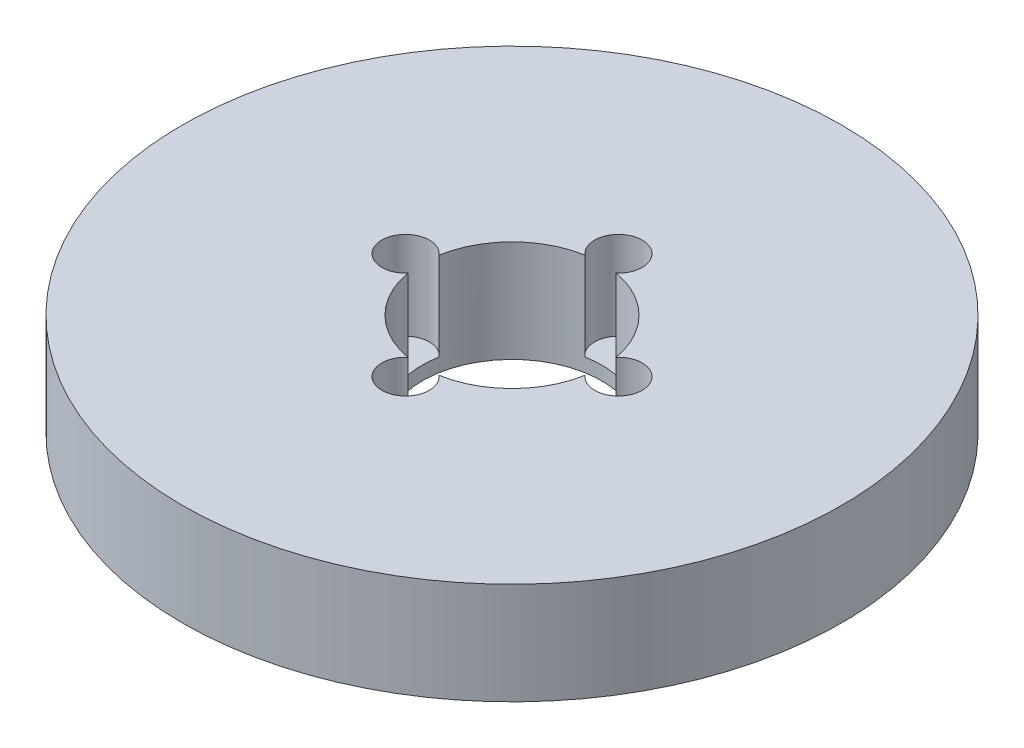
ISO-10303-21;
HEADER;
FILE_DESCRIPTION(('STEP AP214'),'2;1');
FILE_NAME('part.step','',(''),(''),'','','');
FILE_SCHEMA(('AUTOMOTIVE_DESIGN { 1 0 10303 214 1 1 1 1 }'));
ENDSEC;
DATA;
#1=APPLICATION_CONTEXT('core data for automotive mechanical design processes');
#2=APPLICATION_PROTOCOL_DEFINITION('international standard','automotive_design',2000,#1);
#3=PRODUCT_CONTEXT('',#1,'mechanical');
#4=PRODUCT('Part','Part','',(#3));
#5=PRODUCT_RELATED_PRODUCT_CATEGORY('part','',(#4));
#6=PRODUCT_DEFINITION_FORMATION('','',#4);
#7=PRODUCT_DEFINITION_CONTEXT('part definition',#1,'design');
#8=PRODUCT_DEFINITION('design','',#6,#7);
#9=PRODUCT_DEFINITION_SHAPE('','',#8);
#10=(LENGTH_UNIT() NAMED_UNIT(*) SI_UNIT(.MILLI.,.METRE.));
#11=(NAMED_UNIT(*) PLANE_ANGLE_UNIT() SI_UNIT($,.RADIAN.));
#12=(NAMED_UNIT(*) SI_UNIT($,.STERADIAN.) SOLID_ANGLE_UNIT());
#13=UNCERTAINTY_MEASURE_WITH_UNIT(LENGTH_MEASURE(1.E-05),#10,'distance_accuracy_value','');
#14=(GEOMETRIC_REPRESENTATION_CONTEXT(3) GLOBAL_UNCERTAINTY_ASSIGNED_CONTEXT((#13)) GLOBAL_UNIT_ASSIGNED_CONTEXT((#10,
#11,#12)) REPRESENTATION_CONTEXT('',''));
#15=CARTESIAN_POINT('',(0.,0.,0.));
#16=DIRECTION('',(0.,0.,1.));
#17=DIRECTION('',(1.,0.,0.));
#18=AXIS2_PLACEMENT_3D('',#15,#16,#17);
#19=CARTESIAN_POINT('',(0.,17.,0.));
#20=DIRECTION('',(0.,-1.,0.));
#21=DIRECTION('',(0.,0.,-1.));
#22=AXIS2_PLACEMENT_3D('',#19,#20,#21);
#23=CYLINDRICAL_SURFACE('',#22,55.);
#24=CARTESIAN_POINT('',(0.,17.,0.));
#25=DIRECTION('',(0.,1.,0.));
#26=DIRECTION('',(0.,0.,1.));
#27=AXIS2_PLACEMENT_3D('',#24,#25,#26);
#28=CIRCLE('',#27,55.);
#29=CARTESIAN_POINT('',(0.,17.,55.));
#30=VERTEX_POINT('',#29);
#31=EDGE_CURVE('E145',#30,#30,#28,.T.);
#32=ORIENTED_EDGE('',*,*,#31,.F.);
#33=EDGE_LOOP('',(#32));
#34=FACE_BOUND('',#33,.T.);
#35=CARTESIAN_POINT('',(0.,0.,0.));
#36=DIRECTION('',(0.,1.,0.));
#37=DIRECTION('',(0.,0.,1.));
#38=AXIS2_PLACEMENT_3D('',#35,#36,#37);
#39=CIRCLE('',#38,55.);
#40=CARTESIAN_POINT('',(0.,0.,55.));
#41=VERTEX_POINT('',#40);
#42=EDGE_CURVE('E143',#41,#41,#39,.T.);
#43=ORIENTED_EDGE('',*,*,#42,.T.);
#44=EDGE_LOOP('',(#43));
#45=FACE_BOUND('',#44,.T.);
#46=ADVANCED_FACE('F39',(#34,#45),#23,.T.);
#47=CARTESIAN_POINT('',(0.,17.,0.));
#48=DIRECTION('',(0.,1.,0.));
#49=DIRECTION('',(0.,0.,1.));
#50=AXIS2_PLACEMENT_3D('',#47,#48,#49);
#51=PLANE('',#50);
#52=CARTESIAN_POINT('',(0.,17.,17.7588888158018));
#53=DIRECTION('',(0.,1.,0.));
#54=DIRECTION('',(1.,0.,0.));
#55=AXIS2_PLACEMENT_3D('',#52,#53,#54);
#56=CIRCLE('',#55,3.96492053870155);
#57=CARTESIAN_POINT('',(-2.6071492899714,17.,14.7716882102149));
#58=VERTEX_POINT('',#57);
#59=CARTESIAN_POINT('',(2.6071492899715,17.,14.7716882102149));
#60=VERTEX_POINT('',#59);
#61=EDGE_CURVE('E152',#58,#60,#56,.T.);
#62=ORIENTED_EDGE('',*,*,#61,.F.);
#63=CARTESIAN_POINT('',(0.,17.,0.));
#64=DIRECTION('',(0.,1.,0.));
#65=DIRECTION('',(0.,0.,1.));
#66=AXIS2_PLACEMENT_3D('',#63,#64,#65);
#67=CIRCLE('',#66,15.);
#68=CARTESIAN_POINT('',(-14.7716882102149,17.,2.60714928997145));
#69=VERTEX_POINT('',#68);
#70=EDGE_CURVE('E133',#69,#58,#67,.T.);
#71=ORIENTED_EDGE('',*,*,#70,.F.);
#72=CARTESIAN_POINT('',(-17.7588888158018,17.,0.));
#73=DIRECTION('',(0.,1.,0.));
#74=DIRECTION('',(0.,0.,1.));
#75=AXIS2_PLACEMENT_3D('',#72,#73,#74);
#76=CIRCLE('',#75,3.96492053870155);
#77=CARTESIAN_POINT('',(-14.7716882102149,17.,-2.60714928997145));
#78=VERTEX_POINT('',#77);
#79=EDGE_CURVE('E128',#78,#69,#76,.T.);
#80=ORIENTED_EDGE('',*,*,#79,.F.);
#81=CARTESIAN_POINT('',(-2.60714928997161,17.,-14.7716882102149));
#82=VERTEX_POINT('',#81);
#83=EDGE_CURVE('E121',#82,#78,#67,.T.);
#84=ORIENTED_EDGE('',*,*,#83,.F.);
#85=CARTESIAN_POINT('',(-1.86014486696886E-13,17.,-17.7588888158018));
#86=DIRECTION('',(0.,1.,0.));
#87=DIRECTION('',(-1.,0.,0.));
#88=AXIS2_PLACEMENT_3D('',#85,#86,#87);
#89=CIRCLE('',#88,3.96492053870155);
#90=CARTESIAN_POINT('',(2.6071492899713,17.,-14.7716882102149));
#91=VERTEX_POINT('',#90);
#92=EDGE_CURVE('E105',#91,#82,#89,.T.);
#93=ORIENTED_EDGE('',*,*,#92,.F.);
#94=CARTESIAN_POINT('',(14.7716882102149,17.,-2.60714928997145));
#95=VERTEX_POINT('',#94);
#96=EDGE_CURVE('E131',#95,#91,#67,.T.);
#97=ORIENTED_EDGE('',*,*,#96,.F.);
#98=CARTESIAN_POINT('',(17.7588888158018,17.,0.));
#99=DIRECTION('',(0.,1.,0.));
#100=DIRECTION('',(0.,0.,-1.));
#101=AXIS2_PLACEMENT_3D('',#98,#99,#100);
#102=CIRCLE('',#101,3.96492053870155);
#103=CARTESIAN_POINT('',(14.7716882102149,17.,2.60714928997145));
#104=VERTEX_POINT('',#103);
#105=EDGE_CURVE('E154',#104,#95,#102,.T.);
#106=ORIENTED_EDGE('',*,*,#105,.F.);
#107=EDGE_CURVE('E134',#60,#104,#67,.T.);
#108=ORIENTED_EDGE('',*,*,#107,.F.);
#109=EDGE_LOOP('',(#62,#71,#80,#84,#93,#97,#106,#108));
#110=FACE_BOUND('',#109,.T.);
#111=ORIENTED_EDGE('',*,*,#31,.T.);
#112=EDGE_LOOP('',(#111));
#113=FACE_BOUND('',#112,.T.);
#114=ADVANCED_FACE('F130',(#110,#113),#51,.T.);
#115=CARTESIAN_POINT('',(0.,0.,0.));
#116=DIRECTION('',(0.,1.,0.));
#117=DIRECTION('',(0.,0.,1.));
#118=AXIS2_PLACEMENT_3D('',#115,#116,#117);
#119=PLANE('',#118);
#120=CARTESIAN_POINT('',(0.,0.,0.));
#121=DIRECTION('',(0.,1.,0.));
#122=DIRECTION('',(0.,0.,1.));
#123=AXIS2_PLACEMENT_3D('',#120,#121,#122);
#124=CIRCLE('',#123,15.);
#125=CARTESIAN_POINT('',(0.,0.,15.));
#126=VERTEX_POINT('',#125);
#127=EDGE_CURVE('E135',#126,#126,#124,.T.);
#128=ORIENTED_EDGE('',*,*,#127,.T.);
#129=EDGE_LOOP('',(#128));
#130=FACE_BOUND('',#129,.T.);
#131=ORIENTED_EDGE('',*,*,#42,.F.);
#132=EDGE_LOOP('',(#131));
#133=FACE_BOUND('',#132,.T.);
#134=ADVANCED_FACE('F195',(#130,#133),#119,.F.);
#135=CARTESIAN_POINT('',(0.,17.,0.));
#136=DIRECTION('',(0.,-1.,0.));
#137=DIRECTION('',(0.,0.,-1.));
#138=AXIS2_PLACEMENT_3D('',#135,#136,#137);
#139=CYLINDRICAL_SURFACE('',#138,15.);
#140=DIRECTION('',(0.,1.,0.));
#141=VECTOR('',#140,1.);
#142=CARTESIAN_POINT('',(-2.6071492899714,9.63967546323678,14.7716882102149));
#143=LINE('',#142,#141);
#144=CARTESIAN_POINT('',(-2.6071492899714,2.27935092647356,14.7716882102149));
#145=VERTEX_POINT('',#144);
#146=EDGE_CURVE('E11',#145,#58,#143,.T.);
#147=ORIENTED_EDGE('',*,*,#146,.F.);
#148=CARTESIAN_POINT('',(0.,2.27935092647356,0.));
#149=DIRECTION('',(0.,1.,0.));
#150=DIRECTION('',(0.,0.,1.));
#151=AXIS2_PLACEMENT_3D('',#148,#149,#150);
#152=CIRCLE('',#151,15.);
#153=CARTESIAN_POINT('',(2.6071492899715,2.27935092647356,14.7716882102149));
#154=VERTEX_POINT('',#153);
#155=EDGE_CURVE('E169',#145,#154,#152,.T.);
#156=ORIENTED_EDGE('',*,*,#155,.T.);
#157=DIRECTION('',(0.,1.,0.));
#158=VECTOR('',#157,1.);
#159=CARTESIAN_POINT('',(2.60714928997151,9.63967546323678,14.7716882102149));
#160=LINE('',#159,#158);
#161=EDGE_CURVE('E46',#60,#154,#160,.F.);
#162=ORIENTED_EDGE('',*,*,#161,.F.);
#163=ORIENTED_EDGE('',*,*,#107,.T.);
#164=DIRECTION('',(0.,1.,0.));
#165=VECTOR('',#164,1.);
#166=CARTESIAN_POINT('',(14.7716882102149,9.63967546323678,2.60714928997145));
#167=LINE('',#166,#165);
#168=CARTESIAN_POINT('',(14.7716882102149,2.27935092647356,2.60714928997145));
#169=VERTEX_POINT('',#168);
#170=EDGE_CURVE('E151',#169,#104,#167,.T.);
#171=ORIENTED_EDGE('',*,*,#170,.F.);
#172=CARTESIAN_POINT('',(0.,2.27935092647356,0.));
#173=DIRECTION('',(0.,1.,0.));
#174=DIRECTION('',(0.,0.,1.));
#175=AXIS2_PLACEMENT_3D('',#172,#173,#174);
#176=CIRCLE('',#175,15.);
#177=CARTESIAN_POINT('',(14.7716882102149,2.27935092647356,-2.60714928997145));
#178=VERTEX_POINT('',#177);
#179=EDGE_CURVE('E173',#169,#178,#176,.T.);
#180=ORIENTED_EDGE('',*,*,#179,.T.);
#181=DIRECTION('',(0.,1.,0.));
#182=VECTOR('',#181,1.);
#183=CARTESIAN_POINT('',(14.7716882102149,9.63967546323678,-2.60714928997145));
#184=LINE('',#183,#182);
#185=EDGE_CURVE('E168',#95,#178,#184,.F.);
#186=ORIENTED_EDGE('',*,*,#185,.F.);
#187=ORIENTED_EDGE('',*,*,#96,.T.);
#188=DIRECTION('',(0.,1.,0.));
#189=VECTOR('',#188,1.);
#190=CARTESIAN_POINT('',(2.6071492899713,9.63967546323678,-14.7716882102149));
#191=LINE('',#190,#189);
#192=CARTESIAN_POINT('',(2.6071492899713,2.27935092647356,-14.7716882102149));
#193=VERTEX_POINT('',#192);
#194=EDGE_CURVE('E108',#193,#91,#191,.T.);
#195=ORIENTED_EDGE('',*,*,#194,.F.);
#196=CARTESIAN_POINT('',(0.,2.27935092647356,0.));
#197=DIRECTION('',(0.,1.,0.));
#198=DIRECTION('',(0.,0.,1.));
#199=AXIS2_PLACEMENT_3D('',#196,#197,#198);
#200=CIRCLE('',#199,15.);
#201=CARTESIAN_POINT('',(-2.60714928997161,2.27935092647356,-14.7716882102149));
#202=VERTEX_POINT('',#201);
#203=EDGE_CURVE('E122',#193,#202,#200,.T.);
#204=ORIENTED_EDGE('',*,*,#203,.T.);
#205=DIRECTION('',(0.,1.,0.));
#206=VECTOR('',#205,1.);
#207=CARTESIAN_POINT('',(-2.60714928997161,9.63967546323678,-14.7716882102149));
#208=LINE('',#207,#206);
#209=EDGE_CURVE('E106',#82,#202,#208,.F.);
#210=ORIENTED_EDGE('',*,*,#209,.F.);
#211=ORIENTED_EDGE('',*,*,#83,.T.);
#212=DIRECTION('',(0.,1.,0.));
#213=VECTOR('',#212,1.);
#214=CARTESIAN_POINT('',(-14.7716882102149,9.63967546323678,-2.60714928997145));
#215=LINE('',#214,#213);
#216=CARTESIAN_POINT('',(-14.7716882102149,2.27935092647356,-2.60714928997145));
#217=VERTEX_POINT('',#216);
#218=EDGE_CURVE('E177',#217,#78,#215,.T.);
#219=ORIENTED_EDGE('',*,*,#218,.F.);
#220=CARTESIAN_POINT('',(0.,2.27935092647356,0.));
#221=DIRECTION('',(0.,1.,0.));
#222=DIRECTION('',(0.,0.,1.));
#223=AXIS2_PLACEMENT_3D('',#220,#221,#222);
#224=CIRCLE('',#223,15.);
#225=CARTESIAN_POINT('',(-14.7716882102149,2.27935092647356,2.60714928997145));
#226=VERTEX_POINT('',#225);
#227=EDGE_CURVE('E185',#217,#226,#224,.T.);
#228=ORIENTED_EDGE('',*,*,#227,.T.);
#229=DIRECTION('',(0.,1.,0.));
#230=VECTOR('',#229,1.);
#231=CARTESIAN_POINT('',(-14.7716882102149,9.63967546323678,2.60714928997145));
#232=LINE('',#231,#230);
#233=EDGE_CURVE('E179',#69,#226,#232,.F.);
#234=ORIENTED_EDGE('',*,*,#233,.F.);
#235=ORIENTED_EDGE('',*,*,#70,.T.);
#236=EDGE_LOOP('',(#147,#156,#162,#163,#171,#180,#186,#187,#195,#204,#210,#211,#219,#228,#234,#235));
#237=FACE_BOUND('',#236,.T.);
#238=ORIENTED_EDGE('',*,*,#127,.F.);
#239=EDGE_LOOP('',(#238));
#240=FACE_BOUND('',#239,.T.);
#241=ADVANCED_FACE('F117',(#237,#240),#139,.F.);
#242=CARTESIAN_POINT('',(-17.7588888158018,2.27935092647356,0.));
#243=DIRECTION('',(0.,1.,0.));
#244=DIRECTION('',(0.,0.,1.));
#245=AXIS2_PLACEMENT_3D('',#242,#243,#244);
#246=CYLINDRICAL_SURFACE('',#245,3.96492053870155);
#247=ORIENTED_EDGE('',*,*,#218,.T.);
#248=ORIENTED_EDGE('',*,*,#79,.T.);
#249=ORIENTED_EDGE('',*,*,#233,.T.);
#250=CARTESIAN_POINT('',(-17.7588888158018,2.27935092647356,0.));
#251=DIRECTION('',(0.,1.,0.));
#252=DIRECTION('',(0.,0.,1.));
#253=AXIS2_PLACEMENT_3D('',#250,#251,#252);
#254=CIRCLE('',#253,3.96492053870155);
#255=EDGE_CURVE('E140',#217,#226,#254,.T.);
#256=ORIENTED_EDGE('',*,*,#255,.F.);
#257=EDGE_LOOP('',(#247,#248,#249,#256));
#258=FACE_BOUND('',#257,.T.);
#259=ADVANCED_FACE('F200',(#258),#246,.F.);
#260=CARTESIAN_POINT('',(-17.7588888158018,2.27935092647356,0.));
#261=DIRECTION('',(0.,1.,0.));
#262=DIRECTION('',(0.,0.,1.));
#263=AXIS2_PLACEMENT_3D('',#260,#261,#262);
#264=PLANE('',#263);
#265=ORIENTED_EDGE('',*,*,#255,.T.);
#266=ORIENTED_EDGE('',*,*,#227,.F.);
#267=EDGE_LOOP('',(#265,#266));
#268=FACE_BOUND('',#267,.T.);
#269=ADVANCED_FACE('F202',(#268),#264,.T.);
#270=CARTESIAN_POINT('',(-1.86014486696886E-13,2.27935092647356,-17.7588888158018));
#271=DIRECTION('',(0.,1.,0.));
#272=DIRECTION('',(0.,0.,1.));
#273=AXIS2_PLACEMENT_3D('',#270,#271,#272);
#274=CYLINDRICAL_SURFACE('',#273,3.96492053870155);
#275=ORIENTED_EDGE('',*,*,#194,.T.);
#276=ORIENTED_EDGE('',*,*,#92,.T.);
#277=ORIENTED_EDGE('',*,*,#209,.T.);
#278=CARTESIAN_POINT('',(-1.86014486696886E-13,2.27935092647356,-17.7588888158018));
#279=DIRECTION('',(0.,1.,0.));
#280=DIRECTION('',(-1.,0.,0.));
#281=AXIS2_PLACEMENT_3D('',#278,#279,#280);
#282=CIRCLE('',#281,3.96492053870155);
#283=EDGE_CURVE('E111',#193,#202,#282,.T.);
#284=ORIENTED_EDGE('',*,*,#283,.F.);
#285=EDGE_LOOP('',(#275,#276,#277,#284));
#286=FACE_BOUND('',#285,.T.);
#287=ADVANCED_FACE('F102',(#286),#274,.F.);
#288=CARTESIAN_POINT('',(-1.86014486696886E-13,2.27935092647356,-17.7588888158018));
#289=DIRECTION('',(0.,1.,0.));
#290=DIRECTION('',(-1.,0.,0.));
#291=AXIS2_PLACEMENT_3D('',#288,#289,#290);
#292=PLANE('',#291);
#293=ORIENTED_EDGE('',*,*,#283,.T.);
#294=ORIENTED_EDGE('',*,*,#203,.F.);
#295=EDGE_LOOP('',(#293,#294));
#296=FACE_BOUND('',#295,.T.);
#297=ADVANCED_FACE('F211',(#296),#292,.T.);
#298=CARTESIAN_POINT('',(17.7588888158018,2.27935092647356,0.));
#299=DIRECTION('',(0.,1.,0.));
#300=DIRECTION('',(0.,0.,1.));
#301=AXIS2_PLACEMENT_3D('',#298,#299,#300);
#302=CYLINDRICAL_SURFACE('',#301,3.96492053870155);
#303=ORIENTED_EDGE('',*,*,#170,.T.);
#304=ORIENTED_EDGE('',*,*,#105,.T.);
#305=ORIENTED_EDGE('',*,*,#185,.T.);
#306=CARTESIAN_POINT('',(17.7588888158018,2.27935092647356,0.));
#307=DIRECTION('',(0.,1.,0.));
#308=DIRECTION('',(0.,0.,-1.));
#309=AXIS2_PLACEMENT_3D('',#306,#307,#308);
#310=CIRCLE('',#309,3.96492053870155);
#311=EDGE_CURVE('E56',#169,#178,#310,.T.);
#312=ORIENTED_EDGE('',*,*,#311,.F.);
#313=EDGE_LOOP('',(#303,#304,#305,#312));
#314=FACE_BOUND('',#313,.T.);
#315=ADVANCED_FACE('F212',(#314),#302,.F.);
#316=CARTESIAN_POINT('',(17.7588888158018,2.27935092647356,0.));
#317=DIRECTION('',(0.,1.,0.));
#318=DIRECTION('',(0.,0.,-1.));
#319=AXIS2_PLACEMENT_3D('',#316,#317,#318);
#320=PLANE('',#319);
#321=ORIENTED_EDGE('',*,*,#311,.T.);
#322=ORIENTED_EDGE('',*,*,#179,.F.);
#323=EDGE_LOOP('',(#321,#322));
#324=FACE_BOUND('',#323,.T.);
#325=ADVANCED_FACE('F217',(#324),#320,.T.);
#326=CARTESIAN_POINT('',(0.,2.27935092647356,17.7588888158018));
#327=DIRECTION('',(0.,1.,0.));
#328=DIRECTION('',(0.,0.,1.));
#329=AXIS2_PLACEMENT_3D('',#326,#327,#328);
#330=CYLINDRICAL_SURFACE('',#329,3.96492053870155);
#331=ORIENTED_EDGE('',*,*,#146,.T.);
#332=ORIENTED_EDGE('',*,*,#61,.T.);
#333=ORIENTED_EDGE('',*,*,#161,.T.);
#334=CARTESIAN_POINT('',(0.,2.27935092647356,17.7588888158018));
#335=DIRECTION('',(0.,1.,0.));
#336=DIRECTION('',(1.,0.,0.));
#337=AXIS2_PLACEMENT_3D('',#334,#335,#336);
#338=CIRCLE('',#337,3.96492053870155);
#339=EDGE_CURVE('E55',#145,#154,#338,.T.);
#340=ORIENTED_EDGE('',*,*,#339,.F.);
#341=EDGE_LOOP('',(#331,#332,#333,#340));
#342=FACE_BOUND('',#341,.T.);
#343=ADVANCED_FACE('F170',(#342),#330,.F.);
#344=CARTESIAN_POINT('',(0.,2.27935092647356,17.7588888158018));
#345=DIRECTION('',(0.,1.,0.));
#346=DIRECTION('',(1.,0.,0.));
#347=AXIS2_PLACEMENT_3D('',#344,#345,#346);
#348=PLANE('',#347);
#349=ORIENTED_EDGE('',*,*,#339,.T.);
#350=ORIENTED_EDGE('',*,*,#155,.F.);
#351=EDGE_LOOP('',(#349,#350));
#352=FACE_BOUND('',#351,.T.);
#353=ADVANCED_FACE('F224',(#352),#348,.T.);
#354=CLOSED_SHELL('',(#46,#114,#134,#241,#259,#269,#287,#297,#315,#325,#343,#353));
#355=MANIFOLD_SOLID_BREP('B2',#354);
#356=ADVANCED_BREP_SHAPE_REPRESENTATION('',(#18,#355),#14);
#357=SHAPE_DEFINITION_REPRESENTATION(#9,#356);
ENDSEC;
END-ISO-10303-21;
